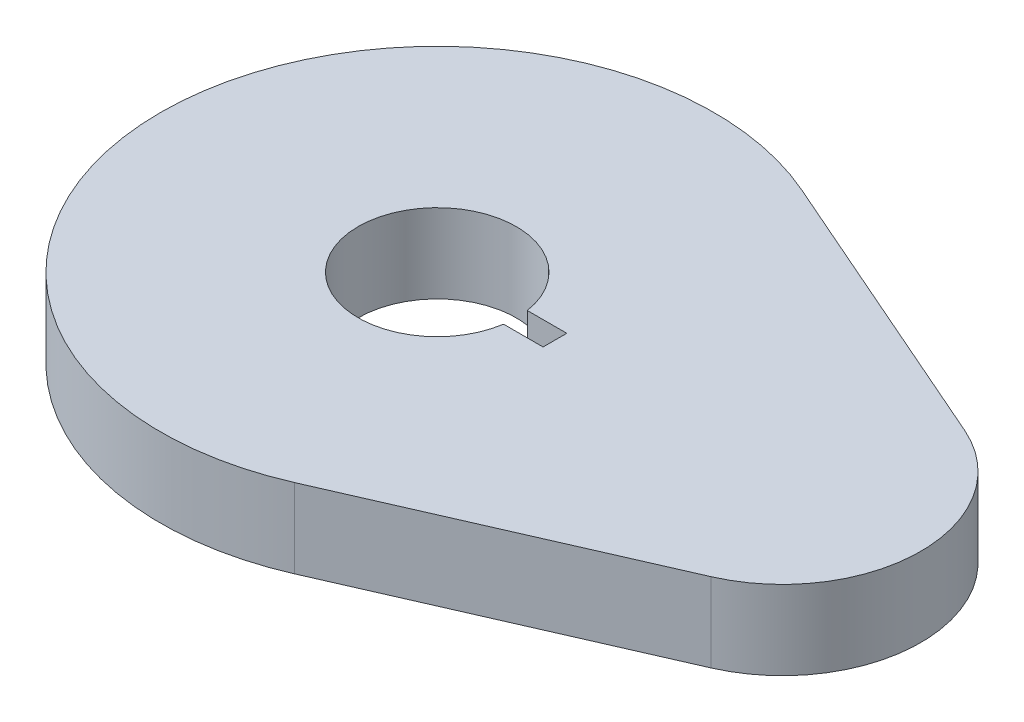
ISO-10303-21;
HEADER;
FILE_DESCRIPTION(('STEP AP214'),'2;1');
FILE_NAME('part.step','',(''),(''),'','','');
FILE_SCHEMA(('AUTOMOTIVE_DESIGN { 1 0 10303 214 1 1 1 1 }'));
ENDSEC;
DATA;
#1=APPLICATION_CONTEXT('core data for automotive mechanical design processes');
#2=APPLICATION_PROTOCOL_DEFINITION('international standard','automotive_design',2000,#1);
#3=PRODUCT_CONTEXT('',#1,'mechanical');
#4=PRODUCT('Part','Part','',(#3));
#5=PRODUCT_RELATED_PRODUCT_CATEGORY('part','',(#4));
#6=PRODUCT_DEFINITION_FORMATION('','',#4);
#7=PRODUCT_DEFINITION_CONTEXT('part definition',#1,'design');
#8=PRODUCT_DEFINITION('design','',#6,#7);
#9=PRODUCT_DEFINITION_SHAPE('','',#8);
#10=(LENGTH_UNIT() NAMED_UNIT(*) SI_UNIT(.MILLI.,.METRE.));
#11=(NAMED_UNIT(*) PLANE_ANGLE_UNIT() SI_UNIT($,.RADIAN.));
#12=(NAMED_UNIT(*) SI_UNIT($,.STERADIAN.) SOLID_ANGLE_UNIT());
#13=UNCERTAINTY_MEASURE_WITH_UNIT(LENGTH_MEASURE(1.E-05),#10,'distance_accuracy_value','');
#14=(GEOMETRIC_REPRESENTATION_CONTEXT(3) GLOBAL_UNCERTAINTY_ASSIGNED_CONTEXT((#13)) GLOBAL_UNIT_ASSIGNED_CONTEXT((#10,
#11,#12)) REPRESENTATION_CONTEXT('',''));
#15=CARTESIAN_POINT('',(0.,0.,0.));
#16=DIRECTION('',(0.,0.,1.));
#17=DIRECTION('',(1.,0.,0.));
#18=AXIS2_PLACEMENT_3D('',#15,#16,#17);
#19=CARTESIAN_POINT('',(43.6606229914325,10.,0.));
#20=DIRECTION('',(0.,-1.,0.));
#21=DIRECTION('',(0.,0.,-1.));
#22=AXIS2_PLACEMENT_3D('',#19,#20,#21);
#23=CYLINDRICAL_SURFACE('',#22,17.5);
#24=CARTESIAN_POINT('',(43.6606229914325,0.,0.));
#25=DIRECTION('',(0.,1.,0.));
#26=DIRECTION('',(0.,0.,1.));
#27=AXIS2_PLACEMENT_3D('',#24,#25,#26);
#28=CIRCLE('',#27,17.5);
#29=CARTESIAN_POINT('',(50.6749525867773,0.,-16.0327533607883));
#30=VERTEX_POINT('',#29);
#31=CARTESIAN_POINT('',(50.6749525867773,0.,16.0327533607883));
#32=VERTEX_POINT('',#31);
#33=EDGE_CURVE('E149',#30,#32,#28,.F.);
#34=ORIENTED_EDGE('',*,*,#33,.F.);
#35=DIRECTION('',(0.,-1.,0.));
#36=VECTOR('',#35,1.);
#37=CARTESIAN_POINT('',(50.6749525867773,10.,-16.0327533607883));
#38=LINE('',#37,#36);
#39=CARTESIAN_POINT('',(50.6749525867773,10.,-16.0327533607883));
#40=VERTEX_POINT('',#39);
#41=EDGE_CURVE('E11',#40,#30,#38,.T.);
#42=ORIENTED_EDGE('',*,*,#41,.F.);
#43=CARTESIAN_POINT('',(43.6606229914325,10.,0.));
#44=DIRECTION('',(0.,1.,0.));
#45=DIRECTION('',(0.,0.,1.));
#46=AXIS2_PLACEMENT_3D('',#43,#44,#45);
#47=CIRCLE('',#46,17.5);
#48=CARTESIAN_POINT('',(50.6749525867773,10.,16.0327533607883));
#49=VERTEX_POINT('',#48);
#50=EDGE_CURVE('E121',#40,#49,#47,.F.);
#51=ORIENTED_EDGE('',*,*,#50,.T.);
#52=DIRECTION('',(0.,-1.,0.));
#53=VECTOR('',#52,1.);
#54=CARTESIAN_POINT('',(50.6749525867773,10.,16.0327533607883));
#55=LINE('',#54,#53);
#56=EDGE_CURVE('E87',#49,#32,#55,.T.);
#57=ORIENTED_EDGE('',*,*,#56,.T.);
#58=EDGE_LOOP('',(#34,#42,#51,#57));
#59=FACE_BOUND('',#58,.T.);
#60=ADVANCED_FACE('F34',(#59),#23,.T.);
#61=CARTESIAN_POINT('',(14.0286591906898,10.,-32.0655067215766));
#62=DIRECTION('',(-0.400818834019708,0.,0.916157334902189));
#63=DIRECTION('',(0.916157334902189,0.,0.400818834019708));
#64=AXIS2_PLACEMENT_3D('',#61,#62,#63);
#65=PLANE('',#64);
#66=DIRECTION('',(-0.916157334902189,0.,-0.400818834019708));
#67=VECTOR('',#66,1.);
#68=CARTESIAN_POINT('',(14.0286591906898,0.,-32.0655067215766));
#69=LINE('',#68,#67);
#70=CARTESIAN_POINT('',(14.0286591906898,0.,-32.0655067215766));
#71=VERTEX_POINT('',#70);
#72=EDGE_CURVE('E126',#30,#71,#69,.T.);
#73=ORIENTED_EDGE('',*,*,#72,.T.);
#74=DIRECTION('',(0.,-1.,0.));
#75=VECTOR('',#74,1.);
#76=CARTESIAN_POINT('',(14.0286591906898,10.,-32.0655067215766));
#77=LINE('',#76,#75);
#78=CARTESIAN_POINT('',(14.0286591906898,10.,-32.0655067215766));
#79=VERTEX_POINT('',#78);
#80=EDGE_CURVE('E44',#79,#71,#77,.T.);
#81=ORIENTED_EDGE('',*,*,#80,.F.);
#82=DIRECTION('',(-0.916157334902189,0.,-0.400818834019708));
#83=VECTOR('',#82,1.);
#84=CARTESIAN_POINT('',(14.0286591906898,10.,-32.0655067215766));
#85=LINE('',#84,#83);
#86=EDGE_CURVE('E117',#40,#79,#85,.T.);
#87=ORIENTED_EDGE('',*,*,#86,.F.);
#88=ORIENTED_EDGE('',*,*,#41,.T.);
#89=EDGE_LOOP('',(#73,#81,#87,#88));
#90=FACE_BOUND('',#89,.T.);
#91=ADVANCED_FACE('F124',(#90),#65,.F.);
#92=CARTESIAN_POINT('',(0.,10.,0.));
#93=DIRECTION('',(0.,-1.,0.));
#94=DIRECTION('',(0.,0.,-1.));
#95=AXIS2_PLACEMENT_3D('',#92,#93,#94);
#96=CYLINDRICAL_SURFACE('',#95,35.);
#97=CARTESIAN_POINT('',(0.,0.,0.));
#98=DIRECTION('',(0.,1.,0.));
#99=DIRECTION('',(0.,0.,1.));
#100=AXIS2_PLACEMENT_3D('',#97,#98,#99);
#101=CIRCLE('',#100,35.);
#102=CARTESIAN_POINT('',(14.0286591906898,0.,32.0655067215766));
#103=VERTEX_POINT('',#102);
#104=EDGE_CURVE('E146',#71,#103,#101,.T.);
#105=ORIENTED_EDGE('',*,*,#104,.T.);
#106=DIRECTION('',(0.,-1.,0.));
#107=VECTOR('',#106,1.);
#108=CARTESIAN_POINT('',(14.0286591906898,10.,32.0655067215766));
#109=LINE('',#108,#107);
#110=CARTESIAN_POINT('',(14.0286591906898,10.,32.0655067215766));
#111=VERTEX_POINT('',#110);
#112=EDGE_CURVE('E116',#111,#103,#109,.T.);
#113=ORIENTED_EDGE('',*,*,#112,.F.);
#114=CARTESIAN_POINT('',(0.,10.,0.));
#115=DIRECTION('',(0.,1.,0.));
#116=DIRECTION('',(0.,0.,1.));
#117=AXIS2_PLACEMENT_3D('',#114,#115,#116);
#118=CIRCLE('',#117,35.);
#119=EDGE_CURVE('E110',#79,#111,#118,.T.);
#120=ORIENTED_EDGE('',*,*,#119,.F.);
#121=ORIENTED_EDGE('',*,*,#80,.T.);
#122=EDGE_LOOP('',(#105,#113,#120,#121));
#123=FACE_BOUND('',#122,.T.);
#124=ADVANCED_FACE('F113',(#123),#96,.T.);
#125=CARTESIAN_POINT('',(0.,10.,0.));
#126=DIRECTION('',(0.,-1.,0.));
#127=DIRECTION('',(0.,0.,-1.));
#128=AXIS2_PLACEMENT_3D('',#125,#126,#127);
#129=CYLINDRICAL_SURFACE('',#128,10.);
#130=CARTESIAN_POINT('',(0.,0.,0.));
#131=DIRECTION('',(0.,1.,0.));
#132=DIRECTION('',(0.,0.,1.));
#133=AXIS2_PLACEMENT_3D('',#130,#131,#132);
#134=CIRCLE('',#133,10.);
#135=CARTESIAN_POINT('',(9.88685996664259,0.,-1.5));
#136=VERTEX_POINT('',#135);
#137=CARTESIAN_POINT('',(9.88685996664259,0.,1.5));
#138=VERTEX_POINT('',#137);
#139=EDGE_CURVE('E158',#136,#138,#134,.T.);
#140=ORIENTED_EDGE('',*,*,#139,.F.);
#141=DIRECTION('',(0.,-1.,0.));
#142=VECTOR('',#141,1.);
#143=CARTESIAN_POINT('',(9.88685996664259,10.,-1.5));
#144=LINE('',#143,#142);
#145=CARTESIAN_POINT('',(9.88685996664259,10.,-1.5));
#146=VERTEX_POINT('',#145);
#147=EDGE_CURVE('E38',#146,#136,#144,.T.);
#148=ORIENTED_EDGE('',*,*,#147,.F.);
#149=CARTESIAN_POINT('',(0.,10.,0.));
#150=DIRECTION('',(0.,1.,0.));
#151=DIRECTION('',(0.,0.,1.));
#152=AXIS2_PLACEMENT_3D('',#149,#150,#151);
#153=CIRCLE('',#152,10.);
#154=CARTESIAN_POINT('',(9.88685996664259,10.,1.5));
#155=VERTEX_POINT('',#154);
#156=EDGE_CURVE('E145',#146,#155,#153,.T.);
#157=ORIENTED_EDGE('',*,*,#156,.T.);
#158=DIRECTION('',(0.,-1.,0.));
#159=VECTOR('',#158,1.);
#160=CARTESIAN_POINT('',(9.88685996664259,10.,1.5));
#161=LINE('',#160,#159);
#162=EDGE_CURVE('E131',#155,#138,#161,.T.);
#163=ORIENTED_EDGE('',*,*,#162,.T.);
#164=EDGE_LOOP('',(#140,#148,#157,#163));
#165=FACE_BOUND('',#164,.T.);
#166=ADVANCED_FACE('F36',(#165),#129,.F.);
#167=CARTESIAN_POINT('',(0.,10.,-1.5));
#168=DIRECTION('',(0.,0.,-1.));
#169=DIRECTION('',(-1.,0.,0.));
#170=AXIS2_PLACEMENT_3D('',#167,#168,#169);
#171=PLANE('',#170);
#172=DIRECTION('',(1.,0.,0.));
#173=VECTOR('',#172,1.);
#174=CARTESIAN_POINT('',(0.,0.,-1.5));
#175=LINE('',#174,#173);
#176=CARTESIAN_POINT('',(14.8868599666426,0.,-1.5));
#177=VERTEX_POINT('',#176);
#178=EDGE_CURVE('E156',#136,#177,#175,.T.);
#179=ORIENTED_EDGE('',*,*,#178,.T.);
#180=DIRECTION('',(0.,-1.,0.));
#181=VECTOR('',#180,1.);
#182=CARTESIAN_POINT('',(14.8868599666426,10.,-1.5));
#183=LINE('',#182,#181);
#184=CARTESIAN_POINT('',(14.8868599666426,10.,-1.5));
#185=VERTEX_POINT('',#184);
#186=EDGE_CURVE('E134',#185,#177,#183,.T.);
#187=ORIENTED_EDGE('',*,*,#186,.F.);
#188=DIRECTION('',(1.,0.,0.));
#189=VECTOR('',#188,1.);
#190=CARTESIAN_POINT('',(0.,10.,-1.5));
#191=LINE('',#190,#189);
#192=EDGE_CURVE('E168',#146,#185,#191,.T.);
#193=ORIENTED_EDGE('',*,*,#192,.F.);
#194=ORIENTED_EDGE('',*,*,#147,.T.);
#195=EDGE_LOOP('',(#179,#187,#193,#194));
#196=FACE_BOUND('',#195,.T.);
#197=ADVANCED_FACE('F179',(#196),#171,.F.);
#198=CARTESIAN_POINT('',(14.8868599666426,10.,0.));
#199=DIRECTION('',(1.,0.,0.));
#200=DIRECTION('',(0.,0.,-1.));
#201=AXIS2_PLACEMENT_3D('',#198,#199,#200);
#202=PLANE('',#201);
#203=DIRECTION('',(0.,0.,1.));
#204=VECTOR('',#203,1.);
#205=CARTESIAN_POINT('',(14.8868599666426,0.,0.));
#206=LINE('',#205,#204);
#207=CARTESIAN_POINT('',(14.8868599666426,0.,1.5));
#208=VERTEX_POINT('',#207);
#209=EDGE_CURVE('E154',#177,#208,#206,.T.);
#210=ORIENTED_EDGE('',*,*,#209,.T.);
#211=DIRECTION('',(0.,-1.,0.));
#212=VECTOR('',#211,1.);
#213=CARTESIAN_POINT('',(14.8868599666426,10.,1.5));
#214=LINE('',#213,#212);
#215=CARTESIAN_POINT('',(14.8868599666426,10.,1.5));
#216=VERTEX_POINT('',#215);
#217=EDGE_CURVE('E133',#216,#208,#214,.T.);
#218=ORIENTED_EDGE('',*,*,#217,.F.);
#219=DIRECTION('',(0.,0.,1.));
#220=VECTOR('',#219,1.);
#221=CARTESIAN_POINT('',(14.8868599666426,10.,0.));
#222=LINE('',#221,#220);
#223=EDGE_CURVE('E166',#185,#216,#222,.T.);
#224=ORIENTED_EDGE('',*,*,#223,.F.);
#225=ORIENTED_EDGE('',*,*,#186,.T.);
#226=EDGE_LOOP('',(#210,#218,#224,#225));
#227=FACE_BOUND('',#226,.T.);
#228=ADVANCED_FACE('F180',(#227),#202,.F.);
#229=CARTESIAN_POINT('',(0.,10.,1.5));
#230=DIRECTION('',(0.,0.,-1.));
#231=DIRECTION('',(-1.,0.,0.));
#232=AXIS2_PLACEMENT_3D('',#229,#230,#231);
#233=PLANE('',#232);
#234=DIRECTION('',(1.,0.,0.));
#235=VECTOR('',#234,1.);
#236=CARTESIAN_POINT('',(0.,0.,1.5));
#237=LINE('',#236,#235);
#238=EDGE_CURVE('E151',#138,#208,#237,.T.);
#239=ORIENTED_EDGE('',*,*,#238,.F.);
#240=ORIENTED_EDGE('',*,*,#162,.F.);
#241=DIRECTION('',(1.,0.,0.));
#242=VECTOR('',#241,1.);
#243=CARTESIAN_POINT('',(0.,10.,1.5));
#244=LINE('',#243,#242);
#245=EDGE_CURVE('E163',#155,#216,#244,.T.);
#246=ORIENTED_EDGE('',*,*,#245,.T.);
#247=ORIENTED_EDGE('',*,*,#217,.T.);
#248=EDGE_LOOP('',(#239,#240,#246,#247));
#249=FACE_BOUND('',#248,.T.);
#250=ADVANCED_FACE('F176',(#249),#233,.T.);
#251=CARTESIAN_POINT('',(14.0286591906898,10.,32.0655067215766));
#252=DIRECTION('',(-0.400818834019708,0.,-0.916157334902189));
#253=DIRECTION('',(-0.916157334902189,0.,0.400818834019708));
#254=AXIS2_PLACEMENT_3D('',#251,#252,#253);
#255=PLANE('',#254);
#256=DIRECTION('',(0.916157334902189,0.,-0.400818834019708));
#257=VECTOR('',#256,1.);
#258=CARTESIAN_POINT('',(14.0286591906898,0.,32.0655067215766));
#259=LINE('',#258,#257);
#260=EDGE_CURVE('E80',#103,#32,#259,.T.);
#261=ORIENTED_EDGE('',*,*,#260,.T.);
#262=ORIENTED_EDGE('',*,*,#56,.F.);
#263=DIRECTION('',(0.916157334902189,0.,-0.400818834019708));
#264=VECTOR('',#263,1.);
#265=CARTESIAN_POINT('',(14.0286591906898,10.,32.0655067215766));
#266=LINE('',#265,#264);
#267=EDGE_CURVE('E53',#111,#49,#266,.T.);
#268=ORIENTED_EDGE('',*,*,#267,.F.);
#269=ORIENTED_EDGE('',*,*,#112,.T.);
#270=EDGE_LOOP('',(#261,#262,#268,#269));
#271=FACE_BOUND('',#270,.T.);
#272=ADVANCED_FACE('F187',(#271),#255,.F.);
#273=CARTESIAN_POINT('',(0.,10.,0.));
#274=DIRECTION('',(0.,1.,0.));
#275=DIRECTION('',(0.,0.,1.));
#276=AXIS2_PLACEMENT_3D('',#273,#274,#275);
#277=PLANE('',#276);
#278=ORIENTED_EDGE('',*,*,#156,.F.);
#279=ORIENTED_EDGE('',*,*,#192,.T.);
#280=ORIENTED_EDGE('',*,*,#223,.T.);
#281=ORIENTED_EDGE('',*,*,#245,.F.);
#282=EDGE_LOOP('',(#278,#279,#280,#281));
#283=FACE_BOUND('',#282,.T.);
#284=ORIENTED_EDGE('',*,*,#50,.F.);
#285=ORIENTED_EDGE('',*,*,#86,.T.);
#286=ORIENTED_EDGE('',*,*,#119,.T.);
#287=ORIENTED_EDGE('',*,*,#267,.T.);
#288=EDGE_LOOP('',(#284,#285,#286,#287));
#289=FACE_BOUND('',#288,.T.);
#290=ADVANCED_FACE('F120',(#283,#289),#277,.T.);
#291=CARTESIAN_POINT('',(0.,0.,0.));
#292=DIRECTION('',(0.,1.,0.));
#293=DIRECTION('',(0.,0.,1.));
#294=AXIS2_PLACEMENT_3D('',#291,#292,#293);
#295=PLANE('',#294);
#296=ORIENTED_EDGE('',*,*,#139,.T.);
#297=ORIENTED_EDGE('',*,*,#238,.T.);
#298=ORIENTED_EDGE('',*,*,#209,.F.);
#299=ORIENTED_EDGE('',*,*,#178,.F.);
#300=EDGE_LOOP('',(#296,#297,#298,#299));
#301=FACE_BOUND('',#300,.T.);
#302=ORIENTED_EDGE('',*,*,#33,.T.);
#303=ORIENTED_EDGE('',*,*,#260,.F.);
#304=ORIENTED_EDGE('',*,*,#104,.F.);
#305=ORIENTED_EDGE('',*,*,#72,.F.);
#306=EDGE_LOOP('',(#302,#303,#304,#305));
#307=FACE_BOUND('',#306,.T.);
#308=ADVANCED_FACE('F178',(#301,#307),#295,.F.);
#309=CLOSED_SHELL('',(#60,#91,#124,#166,#197,#228,#250,#272,#290,#308));
#310=MANIFOLD_SOLID_BREP('B2',#309);
#311=ADVANCED_BREP_SHAPE_REPRESENTATION('',(#18,#310),#14);
#312=SHAPE_DEFINITION_REPRESENTATION(#9,#311);
ENDSEC;
END-ISO-10303-21;
